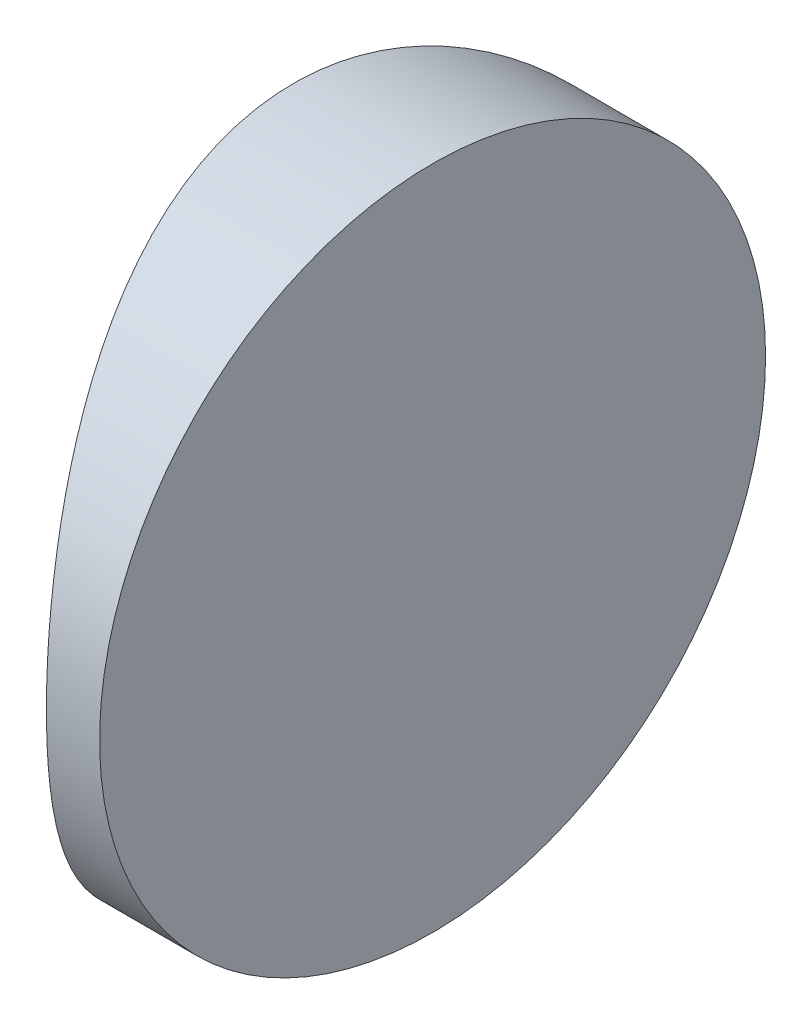
ISO-10303-21;
HEADER;
FILE_DESCRIPTION(('STEP AP214'),'2;1');
FILE_NAME('part.step','',(''),(''),'','','');
FILE_SCHEMA(('AUTOMOTIVE_DESIGN { 1 0 10303 214 1 1 1 1 }'));
ENDSEC;
DATA;
#1=APPLICATION_CONTEXT('core data for automotive mechanical design processes');
#2=APPLICATION_PROTOCOL_DEFINITION('international standard','automotive_design',2000,#1);
#3=PRODUCT_CONTEXT('',#1,'mechanical');
#4=PRODUCT('Part','Part','',(#3));
#5=PRODUCT_RELATED_PRODUCT_CATEGORY('part','',(#4));
#6=PRODUCT_DEFINITION_FORMATION('','',#4);
#7=PRODUCT_DEFINITION_CONTEXT('part definition',#1,'design');
#8=PRODUCT_DEFINITION('design','',#6,#7);
#9=PRODUCT_DEFINITION_SHAPE('','',#8);
#10=(LENGTH_UNIT() NAMED_UNIT(*) SI_UNIT(.MILLI.,.METRE.));
#11=(NAMED_UNIT(*) PLANE_ANGLE_UNIT() SI_UNIT($,.RADIAN.));
#12=(NAMED_UNIT(*) SI_UNIT($,.STERADIAN.) SOLID_ANGLE_UNIT());
#13=UNCERTAINTY_MEASURE_WITH_UNIT(LENGTH_MEASURE(1.E-05),#10,'distance_accuracy_value','');
#14=(GEOMETRIC_REPRESENTATION_CONTEXT(3) GLOBAL_UNCERTAINTY_ASSIGNED_CONTEXT((#13)) GLOBAL_UNIT_ASSIGNED_CONTEXT((#10,
#11,#12)) REPRESENTATION_CONTEXT('',''));
#15=CARTESIAN_POINT('',(0.,0.,0.));
#16=DIRECTION('',(0.,0.,1.));
#17=DIRECTION('',(1.,0.,0.));
#18=AXIS2_PLACEMENT_3D('',#15,#16,#17);
#19=CARTESIAN_POINT('',(4.35520433485127,25.,0.));
#20=DIRECTION('',(0.,-1.,0.));
#21=DIRECTION('',(0.,0.,-1.));
#22=AXIS2_PLACEMENT_3D('',#19,#20,#21);
#23=CYLINDRICAL_SURFACE('',#22,25.85);
#24=CARTESIAN_POINT('',(-21.4947956651487,0.,0.));
#25=CARTESIAN_POINT('',(-21.4947944023092,1.50174155925333E-06,-0.330316279101232));
#26=CARTESIAN_POINT('',(-21.4884493822132,0.0131080314786294,-0.660658592497688));
#27=CARTESIAN_POINT('',(-21.4632335790431,0.0653809452394398,-1.31880808366383));
#28=CARTESIAN_POINT('',(-21.4443614935282,0.10455003899245,-1.64661499424178));
#29=CARTESIAN_POINT('',(-21.3945737394605,0.20851299641533,-2.29738593896728));
#30=CARTESIAN_POINT('',(-21.3636516174339,0.273320591230938,-2.62034728162813));
#31=CARTESIAN_POINT('',(-21.2905581219203,0.427831199274115,-3.25893632198134));
#32=CARTESIAN_POINT('',(-21.2483869362861,0.517533796770979,-3.57456414204348));
#33=CARTESIAN_POINT('',(-21.1539993921204,0.720567864904767,-4.19539007024227));
#34=CARTESIAN_POINT('',(-21.1018165173188,0.833820675700599,-4.50061905846319));
#35=CARTESIAN_POINT('',(-20.9885595061593,1.0830745625325,-5.09991605982041));
#36=CARTESIAN_POINT('',(-20.9274853548069,1.21907567693228,-5.3939840541333));
#37=CARTESIAN_POINT('',(-20.797852792003,1.51268332982518,-5.96935361874773));
#38=CARTESIAN_POINT('',(-20.7292951027967,1.67028778372873,-6.25065641733048));
#39=CARTESIAN_POINT('',(-20.5861845921605,2.00602804412166,-6.79926669933939));
#40=CARTESIAN_POINT('',(-20.5116294147552,2.18417193107815,-7.06656861408871));
#41=CARTESIAN_POINT('',(-20.3537623113083,2.57057970048587,-7.60075067761722));
#42=CARTESIAN_POINT('',(-20.2701934167675,2.77998424785789,-7.86673002950898));
#43=CARTESIAN_POINT('',(-20.1001771135065,3.21915032778784,-8.38033472469108));
#44=CARTESIAN_POINT('',(-20.0137295525334,3.4489129381568,-8.62795909494276));
#45=CARTESIAN_POINT('',(-19.83997921647,3.92770762959932,-9.10383431211124));
#46=CARTESIAN_POINT('',(-19.7526759308577,4.1767519131952,-9.3320726957228));
#47=CARTESIAN_POINT('',(-19.5794072770456,4.69281021896488,-9.76790045078903));
#48=CARTESIAN_POINT('',(-19.4934421520329,4.95982746152952,-9.97548610509116));
#49=CARTESIAN_POINT('',(-19.3190154428397,5.53041127058912,-10.3829868182972));
#50=CARTESIAN_POINT('',(-19.2308196670554,5.83522518826702,-10.5812738114517));
#51=CARTESIAN_POINT('',(-19.0613569442958,6.46229382816124,-10.9511895147364));
#52=CARTESIAN_POINT('',(-18.9800871600871,6.78454131940796,-11.1228291648632));
#53=CARTESIAN_POINT('',(-18.8273017039328,7.44441010027356,-11.4378559445386));
#54=CARTESIAN_POINT('',(-18.7557768022447,7.78201643286398,-11.5812698657886));
#55=CARTESIAN_POINT('',(-18.6250991727768,8.47061137580558,-11.8384542956083));
#56=CARTESIAN_POINT('',(-18.5659428525698,8.82159606532784,-11.9522334139069));
#57=CARTESIAN_POINT('',(-18.4751753037053,9.44641320921058,-12.1244890191964));
#58=CARTESIAN_POINT('',(-18.4403684706397,9.71794958821152,-12.1896842308831));
#59=CARTESIAN_POINT('',(-18.3800168376964,10.2657569330678,-12.3018816591122));
#60=CARTESIAN_POINT('',(-18.3544707436524,10.5420272317137,-12.3488864177889));
#61=CARTESIAN_POINT('',(-18.3133182536682,11.0977907029786,-12.4242679330512));
#62=CARTESIAN_POINT('',(-18.2977102295192,11.377283340021,-12.4526477410885));
#63=CARTESIAN_POINT('',(-18.2768542650044,11.9378444198249,-12.4905117527535));
#64=CARTESIAN_POINT('',(-18.2716033436671,12.2189123858133,-12.5000013933383));
#65=CARTESIAN_POINT('',(-18.2716068990742,12.8277707622749,-12.4999983752555));
#66=CARTESIAN_POINT('',(-18.2787509513225,13.1555682410604,-12.4870913784635));
#67=CARTESIAN_POINT('',(-18.3070626039957,13.8085467840819,-12.4356342384271));
#68=CARTESIAN_POINT('',(-18.3282317588378,14.1337275542615,-12.3970812528081));
#69=CARTESIAN_POINT('',(-18.3838308294911,14.7791863549813,-12.29480212613));
#70=CARTESIAN_POINT('',(-18.4182703947985,15.0994606411899,-12.2310576663813));
#71=CARTESIAN_POINT('',(-18.4991940791725,15.7325893936273,-12.0791704771647));
#72=CARTESIAN_POINT('',(-18.5456780973908,16.0454439219579,-11.9910279519816));
#73=CARTESIAN_POINT('',(-18.6489069970458,16.6602977227674,-11.791771462045));
#74=CARTESIAN_POINT('',(-18.7056020212565,16.9623415499834,-11.680768754577));
#75=CARTESIAN_POINT('',(-18.8277025229021,17.5555895184766,-11.4365188933935));
#76=CARTESIAN_POINT('',(-18.8931112928954,17.8467895088414,-11.3032633264078));
#77=CARTESIAN_POINT('',(-19.0307939290431,18.4168347811029,-11.0155800095565));
#78=CARTESIAN_POINT('',(-19.1030679571754,18.6956797712697,-10.8611517601075));
#79=CARTESIAN_POINT('',(-19.2526066350014,19.2397828648831,-10.5321604282384));
#80=CARTESIAN_POINT('',(-19.3298710659491,19.50504156295,-10.3575982280939));
#81=CARTESIAN_POINT('',(-19.4935918991057,20.0407244632096,-9.97516552828682));
#82=CARTESIAN_POINT('',(-19.5802986235556,20.309982187352,-9.76576681155276));
#83=CARTESIAN_POINT('',(-19.7550755273786,20.8302547020509,-9.32592649089806));
#84=CARTESIAN_POINT('',(-19.8431457650355,21.081268710146,-9.09548398537785));
#85=CARTESIAN_POINT('',(-20.0184802330096,21.5639162358533,-8.61461054397932));
#86=CARTESIAN_POINT('',(-20.1057440794211,21.7955409068459,-8.36417058474606));
#87=CARTESIAN_POINT('',(-20.2772985090784,22.2380335457203,-7.84456297347091));
#88=CARTESIAN_POINT('',(-20.3615886835579,22.4488986670356,-7.57539276173439));
#89=CARTESIAN_POINT('',(-20.5302620155537,22.8610561975264,-7.002199362748));
#90=CARTESIAN_POINT('',(-20.6143194127441,23.0609186652129,-6.69704905701091));
#91=CARTESIAN_POINT('',(-20.7743583565973,23.4339286713872,-6.06898157157288));
#92=CARTESIAN_POINT('',(-20.8503432082824,23.6070871561051,-5.74607174570864));
#93=CARTESIAN_POINT('',(-20.9920326289365,23.9249793583363,-5.0847167152247));
#94=CARTESIAN_POINT('',(-21.0577457824798,24.0697368380982,-4.74628479252578));
#95=CARTESIAN_POINT('',(-21.1769908088867,24.3293619834048,-4.05611115299636));
#96=CARTESIAN_POINT('',(-21.2305258741223,24.4442374833668,-3.70437295254504));
#97=CARTESIAN_POINT('',(-21.3124970700107,24.6186950756467,-3.07672261184176));
#98=CARTESIAN_POINT('',(-21.3438722302271,24.6849307076272,-2.80302220951948));
#99=CARTESIAN_POINT('',(-21.3981055947424,24.7989022439773,-2.2508796485782));
#100=CARTESIAN_POINT('',(-21.4209619803996,24.8466341981525,-1.97243649069831));
#101=CARTESIAN_POINT('',(-21.4577048923656,24.9231602161373,-1.41242461079823));
#102=CARTESIAN_POINT('',(-21.4715931205542,24.9519578731117,-1.13085649212146));
#103=CARTESIAN_POINT('',(-21.4901377527161,24.9903757176183,-0.566198324170234));
#104=CARTESIAN_POINT('',(-21.4947967475081,25.0000012871183,-0.28310872438545));
#105=CARTESIAN_POINT('',(-21.4947944023092,24.9999984982584,0.330316279101246));
#106=CARTESIAN_POINT('',(-21.4884493822132,24.9868919685214,0.660658592497701));
#107=CARTESIAN_POINT('',(-21.4632335790431,24.9346190547606,1.31880808366384));
#108=CARTESIAN_POINT('',(-21.4443614935282,24.8954499610076,1.64661499424179));
#109=CARTESIAN_POINT('',(-21.3945737394605,24.7914870035847,2.29738593896729));
#110=CARTESIAN_POINT('',(-21.3636516174339,24.7266794087691,2.62034728162814));
#111=CARTESIAN_POINT('',(-21.2905581219203,24.5721688007259,3.25893632198135));
#112=CARTESIAN_POINT('',(-21.2483869362861,24.482466203229,3.5745641420435));
#113=CARTESIAN_POINT('',(-21.1539993921204,24.2794321350952,4.19539007024228));
#114=CARTESIAN_POINT('',(-21.1018165173188,24.1661793242994,4.5006190584632));
#115=CARTESIAN_POINT('',(-20.9885595061593,23.9169254374675,5.09991605982042));
#116=CARTESIAN_POINT('',(-20.9274853548069,23.7809243230677,5.39398405413331));
#117=CARTESIAN_POINT('',(-20.797852792003,23.4873166701748,5.96935361874774));
#118=CARTESIAN_POINT('',(-20.7292951027967,23.3297122162713,6.25065641733049));
#119=CARTESIAN_POINT('',(-20.5861845921605,22.9939719558783,6.7992666993394));
#120=CARTESIAN_POINT('',(-20.5116294147552,22.8158280689218,7.06656861408872));
#121=CARTESIAN_POINT('',(-20.3537623113083,22.4294202995141,7.60075067761723));
#122=CARTESIAN_POINT('',(-20.2701934167675,22.2200157521421,7.866730029509));
#123=CARTESIAN_POINT('',(-20.1001771135065,21.7808496722122,8.38033472469109));
#124=CARTESIAN_POINT('',(-20.0137295525334,21.5510870618432,8.62795909494277));
#125=CARTESIAN_POINT('',(-19.83997921647,21.0722923704007,9.10383431211125));
#126=CARTESIAN_POINT('',(-19.7526759308577,20.8232480868048,9.33207269572281));
#127=CARTESIAN_POINT('',(-19.5794072770456,20.3071897810351,9.76790045078904));
#128=CARTESIAN_POINT('',(-19.4934421520329,20.0401725384705,9.97548610509117));
#129=CARTESIAN_POINT('',(-19.3190154428397,19.4695887294109,10.3829868182972));
#130=CARTESIAN_POINT('',(-19.2308196670554,19.164774811733,10.5812738114517));
#131=CARTESIAN_POINT('',(-19.0613569442958,18.5377061718388,10.9511895147364));
#132=CARTESIAN_POINT('',(-18.9800871600871,18.215458680592,11.1228291648632));
#133=CARTESIAN_POINT('',(-18.8273017039328,17.5555898997264,11.4378559445386));
#134=CARTESIAN_POINT('',(-18.7557768022447,17.217983567136,11.5812698657886));
#135=CARTESIAN_POINT('',(-18.6250991727768,16.5293886241944,11.8384542956083));
#136=CARTESIAN_POINT('',(-18.5659428525698,16.1784039346722,11.9522334139069));
#137=CARTESIAN_POINT('',(-18.4751753037053,15.5535867907894,12.1244890191965));
#138=CARTESIAN_POINT('',(-18.4403684706397,15.2820504117885,12.1896842308832));
#139=CARTESIAN_POINT('',(-18.3800168376964,14.7342430669322,12.3018816591122));
#140=CARTESIAN_POINT('',(-18.3544707436524,14.4579727682863,12.3488864177889));
#141=CARTESIAN_POINT('',(-18.3133182536682,13.9022092970214,12.4242679330512));
#142=CARTESIAN_POINT('',(-18.2977102295192,13.622716659979,12.4526477410885));
#143=CARTESIAN_POINT('',(-18.2768542650044,13.0621555801752,12.4905117527535));
#144=CARTESIAN_POINT('',(-18.2716033436671,12.7810876141867,12.5000013933383));
#145=CARTESIAN_POINT('',(-18.2716068990742,12.1722292377251,12.4999983752555));
#146=CARTESIAN_POINT('',(-18.2787509513225,11.8444317589396,12.4870913784635));
#147=CARTESIAN_POINT('',(-18.3070626039957,11.1914532159181,12.4356342384271));
#148=CARTESIAN_POINT('',(-18.3282317588378,10.8662724457385,12.3970812528081));
#149=CARTESIAN_POINT('',(-18.3838308294911,10.2208136450187,12.29480212613));
#150=CARTESIAN_POINT('',(-18.4182703947985,9.90053935881014,12.2310576663813));
#151=CARTESIAN_POINT('',(-18.4991940791725,9.26741060637274,12.0791704771647));
#152=CARTESIAN_POINT('',(-18.5456780973908,8.9545560780421,11.9910279519816));
#153=CARTESIAN_POINT('',(-18.6489069970458,8.33970227723259,11.791771462045));
#154=CARTESIAN_POINT('',(-18.7056020212565,8.0376584500166,11.680768754577));
#155=CARTESIAN_POINT('',(-18.8277025229021,7.44441048152344,11.4365188933935));
#156=CARTESIAN_POINT('',(-18.8931112928954,7.15321049115862,11.3032633264078));
#157=CARTESIAN_POINT('',(-19.0307939290431,6.58316521889711,11.0155800095565));
#158=CARTESIAN_POINT('',(-19.1030679571754,6.30432022873027,10.8611517601075));
#159=CARTESIAN_POINT('',(-19.2526066350014,5.76021713511686,10.5321604282384));
#160=CARTESIAN_POINT('',(-19.3298710659491,5.49495843705002,10.357598228094));
#161=CARTESIAN_POINT('',(-19.4935918991057,4.95927553679037,9.97516552828684));
#162=CARTESIAN_POINT('',(-19.5802986235556,4.69001781264801,9.76576681155277));
#163=CARTESIAN_POINT('',(-19.7550755273786,4.16974529794908,9.32592649089807));
#164=CARTESIAN_POINT('',(-19.8431457650355,3.91873128985404,9.09548398537786));
#165=CARTESIAN_POINT('',(-20.0184802330096,3.43608376414667,8.61461054397933));
#166=CARTESIAN_POINT('',(-20.1057440794211,3.2044590931541,8.36417058474607));
#167=CARTESIAN_POINT('',(-20.2772985090784,2.76196645427974,7.84456297347091));
#168=CARTESIAN_POINT('',(-20.3615886835579,2.55110133296442,7.5753927617344));
#169=CARTESIAN_POINT('',(-20.5302620155537,2.13894380247358,7.00219936274801));
#170=CARTESIAN_POINT('',(-20.6143194127441,1.93908133478712,6.69704905701093));
#171=CARTESIAN_POINT('',(-20.7743583565973,1.56607132861276,6.06898157157289));
#172=CARTESIAN_POINT('',(-20.8503432082824,1.39291284389489,5.74607174570864));
#173=CARTESIAN_POINT('',(-20.9920326289365,1.07502064166373,5.0847167152247));
#174=CARTESIAN_POINT('',(-21.0577457824798,0.930263161901779,4.74628479252578));
#175=CARTESIAN_POINT('',(-21.1769908088867,0.670638016595242,4.05611115299637));
#176=CARTESIAN_POINT('',(-21.2305258741223,0.555762516633189,3.70437295254505));
#177=CARTESIAN_POINT('',(-21.3124970700106,0.381304924353344,3.07672261184177));
#178=CARTESIAN_POINT('',(-21.3438722302271,0.315069292372781,2.80302220951948));
#179=CARTESIAN_POINT('',(-21.3981055947424,0.201097756022672,2.25087964857821));
#180=CARTESIAN_POINT('',(-21.4209619803996,0.153365801847543,1.97243649069831));
#181=CARTESIAN_POINT('',(-21.4577048923656,0.0768397838626573,1.41242461079823));
#182=CARTESIAN_POINT('',(-21.4715931205542,0.0480421268882549,1.13085649212147));
#183=CARTESIAN_POINT('',(-21.4901377527161,0.00962428238169755,0.566198324170243));
#184=CARTESIAN_POINT('',(-21.4947967475081,-1.28711833866018E-06,0.283108724385461));
#185=CARTESIAN_POINT('',(-21.4947956651487,0.,0.));
#186=B_SPLINE_CURVE_WITH_KNOTS('',3,(#24,#25,#26,#27,#28,#29,#30,#31,#32,#33,#34,#35,#36,#37,
#38,#39,#40,#41,#42,#43,#44,#45,#46,#47,#48,#49,#50,#51,#52,#53,#54,#55,#56,#57,#58,#59,#60,#61,
#62,#63,#64,#65,#66,#67,#68,#69,#70,#71,#72,#73,#74,#75,#76,#77,#78,#79,#80,#81,#82,#83,#84,#85,
#86,#87,#88,#89,#90,#91,#92,#93,#94,#95,#96,#97,#98,#99,#100,#101,#102,#103,#104,#105,#106,#107,
#108,#109,#110,#111,#112,#113,#114,#115,#116,#117,#118,#119,#120,#121,#122,#123,#124,#125,#126,
#127,#128,#129,#130,#131,#132,#133,#134,#135,#136,#137,#138,#139,#140,#141,#142,#143,#144,#145,
#146,#147,#148,#149,#150,#151,#152,#153,#154,#155,#156,#157,#158,#159,#160,#161,#162,#163,#164,
#165,#166,#167,#168,#169,#170,#171,#172,#173,#174,#175,#176,#177,#178,#179,#180,#181,#182,#183,
#184,#185),.UNSPECIFIED.,.T.,.F.,(4,2,2,2,2,2,2,2,2,2,2,2,2,2,2,2,2,2,2,2,2,2,2,2,2,2,2,2,2,2,2,
2,2,2,2,2,2,2,2,2,2,2,2,2,2,2,2,2,2,2,2,2,2,2,2,2,2,2,2,2,2,2,2,2,2,2,2,2,2,2,2,2,2,2,2,2,2,2,2,
2,4),(0.,0.99067526165306,1.98145354008148,2.97276316698897,3.96405624065244,4.95209001078018,
5.94012544718761,6.92806561127191,7.91639577803933,8.96132542873449,10.0063104339303,
11.0519622564971,12.0978019400626,13.2189325819219,14.3396017223962,15.4592019448169,
16.5784765287055,17.4219961255192,18.2653977970006,19.1086612537633,19.9516819678135,
20.9347119133246,21.917850827337,22.9017059778662,23.88555289083,24.864720157811,
25.8442584659785,26.8238198909753,27.8033384076006,28.8580461982792,29.9127991980522,
30.9680308480046,32.0234069912422,33.1449775011757,34.2660870390805,35.38625454113,
36.5061280624844,37.355438257381,38.2049296646452,39.0542598172228,39.903351513127,
40.89402677478,41.8848050532084,42.8761146801159,43.8674077537794,44.8554415239071,
45.8434769603146,46.8314171243989,47.8197472911663,48.8646769418614,49.9096619470573,
50.9553137696241,52.0011534531896,53.1222840950488,54.2429532355231,55.3625534579438,
56.4818280418325,57.3253476386462,58.1687493101276,59.0120127668902,59.8550334809404,
60.8380634264515,61.821202340464,62.8050574909932,63.788904403957,64.7680716709379,
65.7476099791054,66.7271714041022,67.7066899207275,68.7613977114061,69.8161507111792,
70.8713823611316,71.9267585043691,73.0483290143027,74.1694385522074,75.289606054257,
76.4094795756114,77.258789770508,78.1082811777721,78.9576113303498,79.8067030262539),.UNSPECIFIED.);
#187=CARTESIAN_POINT('',(-21.4947956651487,0.,0.));
#188=VERTEX_POINT('',#187);
#189=EDGE_CURVE('E10',#188,#188,#186,.T.);
#190=ORIENTED_EDGE('',*,*,#189,.F.);
#191=EDGE_LOOP('',(#190));
#192=FACE_BOUND('',#191,.T.);
#193=ADVANCED_FACE('F35',(#192),#23,.T.);
#194=CARTESIAN_POINT('',(-16.2747956651487,25.,-12.5));
#195=DIRECTION('',(1.,0.,0.));
#196=DIRECTION('',(0.,0.,-1.));
#197=AXIS2_PLACEMENT_3D('',#194,#195,#196);
#198=PLANE('',#197);
#199=CARTESIAN_POINT('',(-16.2747956651487,12.5,0.));
#200=DIRECTION('',(1.,0.,0.));
#201=DIRECTION('',(0.,0.,-1.));
#202=AXIS2_PLACEMENT_3D('',#199,#200,#201);
#203=CIRCLE('',#202,12.5);
#204=CARTESIAN_POINT('',(-16.2747956651487,12.5,-12.5));
#205=VERTEX_POINT('',#204);
#206=EDGE_CURVE('E45',#205,#205,#203,.T.);
#207=ORIENTED_EDGE('',*,*,#206,.T.);
#208=EDGE_LOOP('',(#207));
#209=FACE_BOUND('',#208,.T.);
#210=ADVANCED_FACE('F37',(#209),#198,.T.);
#211=CARTESIAN_POINT('',(-28.9747956651487,12.5,0.));
#212=DIRECTION('',(1.,0.,0.));
#213=DIRECTION('',(0.,0.,-1.));
#214=AXIS2_PLACEMENT_3D('',#211,#212,#213);
#215=CYLINDRICAL_SURFACE('',#214,12.5);
#216=ORIENTED_EDGE('',*,*,#206,.F.);
#217=EDGE_LOOP('',(#216));
#218=FACE_BOUND('',#217,.T.);
#219=ORIENTED_EDGE('',*,*,#189,.T.);
#220=EDGE_LOOP('',(#219));
#221=FACE_BOUND('',#220,.T.);
#222=ADVANCED_FACE('F52',(#218,#221),#215,.T.);
#223=CLOSED_SHELL('',(#193,#210,#222));
#224=MANIFOLD_SOLID_BREP('B2',#223);
#225=ADVANCED_BREP_SHAPE_REPRESENTATION('',(#18,#224),#14);
#226=SHAPE_DEFINITION_REPRESENTATION(#9,#225);
ENDSEC;
END-ISO-10303-21;
